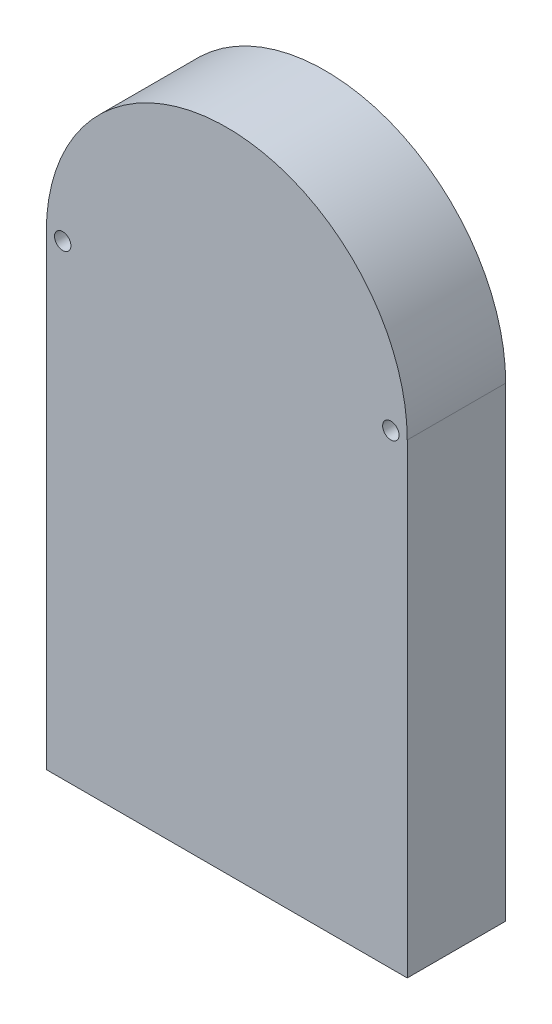
ISO-10303-21;
HEADER;
FILE_DESCRIPTION(('STEP AP214'),'2;1');
FILE_NAME('part.step','',(''),(''),'','','');
FILE_SCHEMA(('AUTOMOTIVE_DESIGN { 1 0 10303 214 1 1 1 1 }'));
ENDSEC;
DATA;
#1=APPLICATION_CONTEXT('core data for automotive mechanical design processes');
#2=APPLICATION_PROTOCOL_DEFINITION('international standard','automotive_design',2000,#1);
#3=PRODUCT_CONTEXT('',#1,'mechanical');
#4=PRODUCT('Part','Part','',(#3));
#5=PRODUCT_RELATED_PRODUCT_CATEGORY('part','',(#4));
#6=PRODUCT_DEFINITION_FORMATION('','',#4);
#7=PRODUCT_DEFINITION_CONTEXT('part definition',#1,'design');
#8=PRODUCT_DEFINITION('design','',#6,#7);
#9=PRODUCT_DEFINITION_SHAPE('','',#8);
#10=(LENGTH_UNIT() NAMED_UNIT(*) SI_UNIT(.MILLI.,.METRE.));
#11=(NAMED_UNIT(*) PLANE_ANGLE_UNIT() SI_UNIT($,.RADIAN.));
#12=(NAMED_UNIT(*) SI_UNIT($,.STERADIAN.) SOLID_ANGLE_UNIT());
#13=UNCERTAINTY_MEASURE_WITH_UNIT(LENGTH_MEASURE(1.E-05),#10,'distance_accuracy_value','');
#14=(GEOMETRIC_REPRESENTATION_CONTEXT(3) GLOBAL_UNCERTAINTY_ASSIGNED_CONTEXT((#13)) GLOBAL_UNIT_ASSIGNED_CONTEXT((#10,
#11,#12)) REPRESENTATION_CONTEXT('',''));
#15=CARTESIAN_POINT('',(0.,0.,0.));
#16=DIRECTION('',(0.,0.,1.));
#17=DIRECTION('',(1.,0.,0.));
#18=AXIS2_PLACEMENT_3D('',#15,#16,#17);
#19=CARTESIAN_POINT('',(42.7485380116959,10.,25.));
#20=DIRECTION('',(0.,-1.,0.));
#21=DIRECTION('',(0.,0.,-1.));
#22=AXIS2_PLACEMENT_3D('',#19,#20,#21);
#23=PLANE('',#22);
#24=CARTESIAN_POINT('',(-42.2514619883041,10.,15.));
#25=DIRECTION('',(0.,-1.,0.));
#26=DIRECTION('',(0.,0.,-1.));
#27=AXIS2_PLACEMENT_3D('',#24,#25,#26);
#28=CIRCLE('',#27,2.49999999999999);
#29=CARTESIAN_POINT('',(-42.2514619883041,10.,12.5));
#30=VERTEX_POINT('',#29);
#31=EDGE_CURVE('E256',#30,#30,#28,.F.);
#32=ORIENTED_EDGE('',*,*,#31,.F.);
#33=EDGE_LOOP('',(#32));
#34=FACE_BOUND('',#33,.T.);
#35=DIRECTION('',(-1.,0.,0.));
#36=VECTOR('',#35,1.);
#37=CARTESIAN_POINT('',(42.7485380116959,10.,0.));
#38=LINE('',#37,#36);
#39=CARTESIAN_POINT('',(42.7485380116959,10.,0.));
#40=VERTEX_POINT('',#39);
#41=CARTESIAN_POINT('',(-47.2514619883041,10.,0.));
#42=VERTEX_POINT('',#41);
#43=EDGE_CURVE('E139',#40,#42,#38,.T.);
#44=ORIENTED_EDGE('',*,*,#43,.T.);
#45=DIRECTION('',(0.,0.,-1.));
#46=VECTOR('',#45,1.);
#47=CARTESIAN_POINT('',(-47.2514619883041,10.,25.));
#48=LINE('',#47,#46);
#49=CARTESIAN_POINT('',(-47.2514619883041,10.,25.));
#50=VERTEX_POINT('',#49);
#51=EDGE_CURVE('E114',#50,#42,#48,.T.);
#52=ORIENTED_EDGE('',*,*,#51,.F.);
#53=DIRECTION('',(-1.,0.,0.));
#54=VECTOR('',#53,1.);
#55=CARTESIAN_POINT('',(42.7485380116959,10.,25.));
#56=LINE('',#55,#54);
#57=CARTESIAN_POINT('',(42.7485380116959,10.,25.));
#58=VERTEX_POINT('',#57);
#59=EDGE_CURVE('E118',#58,#50,#56,.T.);
#60=ORIENTED_EDGE('',*,*,#59,.F.);
#61=DIRECTION('',(0.,0.,-1.));
#62=VECTOR('',#61,1.);
#63=CARTESIAN_POINT('',(42.7485380116959,10.,25.));
#64=LINE('',#63,#62);
#65=EDGE_CURVE('E105',#58,#40,#64,.T.);
#66=ORIENTED_EDGE('',*,*,#65,.T.);
#67=EDGE_LOOP('',(#44,#52,#60,#66));
#68=FACE_BOUND('',#67,.T.);
#69=CARTESIAN_POINT('',(37.7485380116959,10.,15.));
#70=DIRECTION('',(0.,-1.,0.));
#71=DIRECTION('',(0.,0.,-1.));
#72=AXIS2_PLACEMENT_3D('',#69,#70,#71);
#73=CIRCLE('',#72,2.49999999999999);
#74=CARTESIAN_POINT('',(37.7485380116959,10.,12.5));
#75=VERTEX_POINT('',#74);
#76=EDGE_CURVE('E140',#75,#75,#73,.F.);
#77=ORIENTED_EDGE('',*,*,#76,.F.);
#78=EDGE_LOOP('',(#77));
#79=FACE_BOUND('',#78,.T.);
#80=ADVANCED_FACE('F33',(#34,#68,#79),#23,.F.);
#81=CARTESIAN_POINT('',(-57.2514619883041,0.,30.));
#82=DIRECTION('',(1.,0.,0.));
#83=DIRECTION('',(0.,0.,-1.));
#84=AXIS2_PLACEMENT_3D('',#81,#82,#83);
#85=PLANE('',#84);
#86=DIRECTION('',(0.,-1.,0.));
#87=VECTOR('',#86,1.);
#88=CARTESIAN_POINT('',(-57.2514619883041,0.,0.));
#89=LINE('',#88,#87);
#90=CARTESIAN_POINT('',(-57.2514619883041,142.,0.));
#91=VERTEX_POINT('',#90);
#92=CARTESIAN_POINT('',(-57.2514619883041,0.,0.));
#93=VERTEX_POINT('',#92);
#94=EDGE_CURVE('E146',#91,#93,#89,.T.);
#95=ORIENTED_EDGE('',*,*,#94,.T.);
#96=DIRECTION('',(0.,0.,-1.));
#97=VECTOR('',#96,1.);
#98=CARTESIAN_POINT('',(-57.2514619883041,0.,30.));
#99=LINE('',#98,#97);
#100=CARTESIAN_POINT('',(-57.2514619883041,0.,30.));
#101=VERTEX_POINT('',#100);
#102=EDGE_CURVE('E11',#101,#93,#99,.T.);
#103=ORIENTED_EDGE('',*,*,#102,.F.);
#104=DIRECTION('',(0.,-1.,0.));
#105=VECTOR('',#104,1.);
#106=CARTESIAN_POINT('',(-57.2514619883041,0.,30.));
#107=LINE('',#106,#105);
#108=CARTESIAN_POINT('',(-57.2514619883041,142.,30.));
#109=VERTEX_POINT('',#108);
#110=EDGE_CURVE('E150',#109,#101,#107,.T.);
#111=ORIENTED_EDGE('',*,*,#110,.F.);
#112=DIRECTION('',(0.,0.,-1.));
#113=VECTOR('',#112,1.);
#114=CARTESIAN_POINT('',(-57.2514619883041,142.,30.));
#115=LINE('',#114,#113);
#116=EDGE_CURVE('E156',#109,#91,#115,.T.);
#117=ORIENTED_EDGE('',*,*,#116,.T.);
#118=EDGE_LOOP('',(#95,#103,#111,#117));
#119=FACE_BOUND('',#118,.T.);
#120=ADVANCED_FACE('F35',(#119),#85,.F.);
#121=CARTESIAN_POINT('',(-57.2514619883041,0.,30.));
#122=DIRECTION('',(0.,1.,0.));
#123=DIRECTION('',(0.,0.,1.));
#124=AXIS2_PLACEMENT_3D('',#121,#122,#123);
#125=PLANE('',#124);
#126=CARTESIAN_POINT('',(-42.2514619883041,0.,15.));
#127=DIRECTION('',(0.,-1.,0.));
#128=DIRECTION('',(0.,0.,-1.));
#129=AXIS2_PLACEMENT_3D('',#126,#127,#128);
#130=CIRCLE('',#129,2.49999999999999);
#131=CARTESIAN_POINT('',(-42.2514619883041,0.,12.5));
#132=VERTEX_POINT('',#131);
#133=EDGE_CURVE('E255',#132,#132,#130,.T.);
#134=ORIENTED_EDGE('',*,*,#133,.F.);
#135=EDGE_LOOP('',(#134));
#136=FACE_BOUND('',#135,.T.);
#137=CARTESIAN_POINT('',(37.7485380116959,0.,15.));
#138=DIRECTION('',(0.,-1.,0.));
#139=DIRECTION('',(0.,0.,-1.));
#140=AXIS2_PLACEMENT_3D('',#137,#138,#139);
#141=CIRCLE('',#140,2.49999999999999);
#142=CARTESIAN_POINT('',(37.7485380116959,0.,12.5));
#143=VERTEX_POINT('',#142);
#144=EDGE_CURVE('E133',#143,#143,#141,.T.);
#145=ORIENTED_EDGE('',*,*,#144,.F.);
#146=EDGE_LOOP('',(#145));
#147=FACE_BOUND('',#146,.T.);
#148=DIRECTION('',(1.,0.,0.));
#149=VECTOR('',#148,1.);
#150=CARTESIAN_POINT('',(-57.2514619883041,0.,0.));
#151=LINE('',#150,#149);
#152=CARTESIAN_POINT('',(52.7485380116959,0.,0.));
#153=VERTEX_POINT('',#152);
#154=EDGE_CURVE('E159',#93,#153,#151,.T.);
#155=ORIENTED_EDGE('',*,*,#154,.T.);
#156=DIRECTION('',(0.,0.,-1.));
#157=VECTOR('',#156,1.);
#158=CARTESIAN_POINT('',(52.7485380116959,0.,30.));
#159=LINE('',#158,#157);
#160=CARTESIAN_POINT('',(52.7485380116959,0.,30.));
#161=VERTEX_POINT('',#160);
#162=EDGE_CURVE('E41',#161,#153,#159,.T.);
#163=ORIENTED_EDGE('',*,*,#162,.F.);
#164=DIRECTION('',(1.,0.,0.));
#165=VECTOR('',#164,1.);
#166=CARTESIAN_POINT('',(-57.2514619883041,0.,30.));
#167=LINE('',#166,#165);
#168=EDGE_CURVE('E85',#101,#161,#167,.T.);
#169=ORIENTED_EDGE('',*,*,#168,.F.);
#170=ORIENTED_EDGE('',*,*,#102,.T.);
#171=EDGE_LOOP('',(#155,#163,#169,#170));
#172=FACE_BOUND('',#171,.T.);
#173=ADVANCED_FACE('F188',(#136,#147,#172),#125,.F.);
#174=CARTESIAN_POINT('',(52.7485380116959,0.,30.));
#175=DIRECTION('',(-1.,0.,0.));
#176=DIRECTION('',(0.,0.,1.));
#177=AXIS2_PLACEMENT_3D('',#174,#175,#176);
#178=PLANE('',#177);
#179=DIRECTION('',(0.,1.,0.));
#180=VECTOR('',#179,1.);
#181=CARTESIAN_POINT('',(52.7485380116959,0.,0.));
#182=LINE('',#181,#180);
#183=CARTESIAN_POINT('',(52.7485380116959,142.,0.));
#184=VERTEX_POINT('',#183);
#185=EDGE_CURVE('E161',#153,#184,#182,.T.);
#186=ORIENTED_EDGE('',*,*,#185,.T.);
#187=DIRECTION('',(0.,0.,-1.));
#188=VECTOR('',#187,1.);
#189=CARTESIAN_POINT('',(52.7485380116959,142.,30.));
#190=LINE('',#189,#188);
#191=CARTESIAN_POINT('',(52.7485380116959,142.,30.));
#192=VERTEX_POINT('',#191);
#193=EDGE_CURVE('E165',#192,#184,#190,.T.);
#194=ORIENTED_EDGE('',*,*,#193,.F.);
#195=DIRECTION('',(0.,1.,0.));
#196=VECTOR('',#195,1.);
#197=CARTESIAN_POINT('',(52.7485380116959,0.,30.));
#198=LINE('',#197,#196);
#199=EDGE_CURVE('E153',#161,#192,#198,.T.);
#200=ORIENTED_EDGE('',*,*,#199,.F.);
#201=ORIENTED_EDGE('',*,*,#162,.T.);
#202=EDGE_LOOP('',(#186,#194,#200,#201));
#203=FACE_BOUND('',#202,.T.);
#204=ADVANCED_FACE('F170',(#203),#178,.F.);
#205=CARTESIAN_POINT('',(-2.25146198830407,142.,30.));
#206=DIRECTION('',(0.,0.,-1.));
#207=DIRECTION('',(-1.,0.,0.));
#208=AXIS2_PLACEMENT_3D('',#205,#206,#207);
#209=CYLINDRICAL_SURFACE('',#208,55.);
#210=CARTESIAN_POINT('',(-2.25146198830407,142.,0.));
#211=DIRECTION('',(0.,0.,1.));
#212=DIRECTION('',(-1.,0.,0.));
#213=AXIS2_PLACEMENT_3D('',#210,#211,#212);
#214=CIRCLE('',#213,55.);
#215=EDGE_CURVE('E78',#184,#91,#214,.T.);
#216=ORIENTED_EDGE('',*,*,#215,.T.);
#217=ORIENTED_EDGE('',*,*,#116,.F.);
#218=CARTESIAN_POINT('',(-2.25146198830407,142.,30.));
#219=DIRECTION('',(0.,0.,1.));
#220=DIRECTION('',(-1.,0.,0.));
#221=AXIS2_PLACEMENT_3D('',#218,#219,#220);
#222=CIRCLE('',#221,55.);
#223=EDGE_CURVE('E57',#192,#109,#222,.T.);
#224=ORIENTED_EDGE('',*,*,#223,.F.);
#225=ORIENTED_EDGE('',*,*,#193,.T.);
#226=EDGE_LOOP('',(#216,#217,#224,#225));
#227=FACE_BOUND('',#226,.T.);
#228=ADVANCED_FACE('F178',(#227),#209,.T.);
#229=CARTESIAN_POINT('',(-2.25146198830407,142.,30.));
#230=DIRECTION('',(0.,0.,-1.));
#231=DIRECTION('',(-1.,0.,0.));
#232=AXIS2_PLACEMENT_3D('',#229,#230,#231);
#233=PLANE('',#232);
#234=CARTESIAN_POINT('',(47.7485380116959,142.,30.));
#235=DIRECTION('',(0.,0.,-1.));
#236=DIRECTION('',(-1.,0.,0.));
#237=AXIS2_PLACEMENT_3D('',#234,#235,#236);
#238=CIRCLE('',#237,2.5);
#239=CARTESIAN_POINT('',(45.2485380116959,142.,30.));
#240=VERTEX_POINT('',#239);
#241=EDGE_CURVE('E247',#240,#240,#238,.T.);
#242=ORIENTED_EDGE('',*,*,#241,.T.);
#243=EDGE_LOOP('',(#242));
#244=FACE_BOUND('',#243,.T.);
#245=CARTESIAN_POINT('',(-52.2514619883041,142.,30.));
#246=DIRECTION('',(0.,0.,-1.));
#247=DIRECTION('',(-1.,0.,0.));
#248=AXIS2_PLACEMENT_3D('',#245,#246,#247);
#249=CIRCLE('',#248,2.5);
#250=CARTESIAN_POINT('',(-54.7514619883041,142.,30.));
#251=VERTEX_POINT('',#250);
#252=EDGE_CURVE('E252',#251,#251,#249,.T.);
#253=ORIENTED_EDGE('',*,*,#252,.T.);
#254=EDGE_LOOP('',(#253));
#255=FACE_BOUND('',#254,.T.);
#256=ORIENTED_EDGE('',*,*,#110,.T.);
#257=ORIENTED_EDGE('',*,*,#168,.T.);
#258=ORIENTED_EDGE('',*,*,#199,.T.);
#259=ORIENTED_EDGE('',*,*,#223,.T.);
#260=EDGE_LOOP('',(#256,#257,#258,#259));
#261=FACE_BOUND('',#260,.T.);
#262=ADVANCED_FACE('F180',(#244,#255,#261),#233,.F.);
#263=CARTESIAN_POINT('',(-2.25146198830407,142.,0.));
#264=DIRECTION('',(0.,0.,-1.));
#265=DIRECTION('',(-1.,0.,0.));
#266=AXIS2_PLACEMENT_3D('',#263,#264,#265);
#267=PLANE('',#266);
#268=CARTESIAN_POINT('',(47.7485380116959,142.,0.));
#269=DIRECTION('',(0.,0.,-1.));
#270=DIRECTION('',(-1.,0.,0.));
#271=AXIS2_PLACEMENT_3D('',#268,#269,#270);
#272=CIRCLE('',#271,2.49999999999999);
#273=CARTESIAN_POINT('',(45.248538011696,142.,0.));
#274=VERTEX_POINT('',#273);
#275=EDGE_CURVE('E211',#274,#274,#272,.T.);
#276=ORIENTED_EDGE('',*,*,#275,.F.);
#277=EDGE_LOOP('',(#276));
#278=FACE_BOUND('',#277,.T.);
#279=CARTESIAN_POINT('',(-52.2514619883041,142.,0.));
#280=DIRECTION('',(0.,0.,-1.));
#281=DIRECTION('',(-1.,0.,0.));
#282=AXIS2_PLACEMENT_3D('',#279,#280,#281);
#283=CIRCLE('',#282,2.49999999999999);
#284=CARTESIAN_POINT('',(-54.7514619883041,142.,0.));
#285=VERTEX_POINT('',#284);
#286=EDGE_CURVE('E215',#285,#285,#283,.T.);
#287=ORIENTED_EDGE('',*,*,#286,.F.);
#288=EDGE_LOOP('',(#287));
#289=FACE_BOUND('',#288,.T.);
#290=DIRECTION('',(0.,-1.,0.));
#291=VECTOR('',#290,1.);
#292=CARTESIAN_POINT('',(42.7485380116959,10.,0.));
#293=LINE('',#292,#291);
#294=CARTESIAN_POINT('',(42.7485380116959,142.,0.));
#295=VERTEX_POINT('',#294);
#296=EDGE_CURVE('E48',#295,#40,#293,.T.);
#297=ORIENTED_EDGE('',*,*,#296,.F.);
#298=CARTESIAN_POINT('',(-2.25146198830407,142.,0.));
#299=DIRECTION('',(0.,0.,-1.));
#300=DIRECTION('',(1.,0.,0.));
#301=AXIS2_PLACEMENT_3D('',#298,#299,#300);
#302=CIRCLE('',#301,45.);
#303=CARTESIAN_POINT('',(-47.2514619883041,142.,0.));
#304=VERTEX_POINT('',#303);
#305=EDGE_CURVE('E127',#304,#295,#302,.T.);
#306=ORIENTED_EDGE('',*,*,#305,.F.);
#307=DIRECTION('',(0.,1.,0.));
#308=VECTOR('',#307,1.);
#309=CARTESIAN_POINT('',(-47.2514619883041,10.,0.));
#310=LINE('',#309,#308);
#311=EDGE_CURVE('E130',#42,#304,#310,.T.);
#312=ORIENTED_EDGE('',*,*,#311,.F.);
#313=ORIENTED_EDGE('',*,*,#43,.F.);
#314=EDGE_LOOP('',(#297,#306,#312,#313));
#315=FACE_BOUND('',#314,.T.);
#316=ORIENTED_EDGE('',*,*,#94,.F.);
#317=ORIENTED_EDGE('',*,*,#215,.F.);
#318=ORIENTED_EDGE('',*,*,#185,.F.);
#319=ORIENTED_EDGE('',*,*,#154,.F.);
#320=EDGE_LOOP('',(#316,#317,#318,#319));
#321=FACE_BOUND('',#320,.T.);
#322=ADVANCED_FACE('F174',(#278,#289,#315,#321),#267,.T.);
#323=CARTESIAN_POINT('',(42.7485380116959,10.,25.));
#324=DIRECTION('',(1.,0.,0.));
#325=DIRECTION('',(0.,0.,-1.));
#326=AXIS2_PLACEMENT_3D('',#323,#324,#325);
#327=PLANE('',#326);
#328=ORIENTED_EDGE('',*,*,#296,.T.);
#329=ORIENTED_EDGE('',*,*,#65,.F.);
#330=DIRECTION('',(0.,-1.,0.));
#331=VECTOR('',#330,1.);
#332=CARTESIAN_POINT('',(42.7485380116959,10.,25.));
#333=LINE('',#332,#331);
#334=CARTESIAN_POINT('',(42.7485380116959,142.,25.));
#335=VERTEX_POINT('',#334);
#336=EDGE_CURVE('E109',#335,#58,#333,.T.);
#337=ORIENTED_EDGE('',*,*,#336,.F.);
#338=DIRECTION('',(0.,0.,-1.));
#339=VECTOR('',#338,1.);
#340=CARTESIAN_POINT('',(42.7485380116959,142.,25.));
#341=LINE('',#340,#339);
#342=EDGE_CURVE('E144',#335,#295,#341,.T.);
#343=ORIENTED_EDGE('',*,*,#342,.T.);
#344=EDGE_LOOP('',(#328,#329,#337,#343));
#345=FACE_BOUND('',#344,.T.);
#346=ADVANCED_FACE('F107',(#345),#327,.F.);
#347=CARTESIAN_POINT('',(-2.25146198830407,142.,25.));
#348=DIRECTION('',(0.,0.,-1.));
#349=DIRECTION('',(-1.,0.,0.));
#350=AXIS2_PLACEMENT_3D('',#347,#348,#349);
#351=CYLINDRICAL_SURFACE('',#350,45.);
#352=ORIENTED_EDGE('',*,*,#305,.T.);
#353=ORIENTED_EDGE('',*,*,#342,.F.);
#354=CARTESIAN_POINT('',(-2.25146198830407,142.,25.));
#355=DIRECTION('',(0.,0.,-1.));
#356=DIRECTION('',(1.,0.,0.));
#357=AXIS2_PLACEMENT_3D('',#354,#355,#356);
#358=CIRCLE('',#357,45.);
#359=CARTESIAN_POINT('',(-47.2514619883041,142.,25.));
#360=VERTEX_POINT('',#359);
#361=EDGE_CURVE('E115',#360,#335,#358,.T.);
#362=ORIENTED_EDGE('',*,*,#361,.F.);
#363=DIRECTION('',(0.,0.,-1.));
#364=VECTOR('',#363,1.);
#365=CARTESIAN_POINT('',(-47.2514619883041,142.,25.));
#366=LINE('',#365,#364);
#367=EDGE_CURVE('E147',#360,#304,#366,.T.);
#368=ORIENTED_EDGE('',*,*,#367,.T.);
#369=EDGE_LOOP('',(#352,#353,#362,#368));
#370=FACE_BOUND('',#369,.T.);
#371=ADVANCED_FACE('F203',(#370),#351,.F.);
#372=CARTESIAN_POINT('',(-47.2514619883041,10.,25.));
#373=DIRECTION('',(-1.,0.,0.));
#374=DIRECTION('',(0.,-1.,0.));
#375=AXIS2_PLACEMENT_3D('',#372,#373,#374);
#376=PLANE('',#375);
#377=ORIENTED_EDGE('',*,*,#311,.T.);
#378=ORIENTED_EDGE('',*,*,#367,.F.);
#379=DIRECTION('',(0.,1.,0.));
#380=VECTOR('',#379,1.);
#381=CARTESIAN_POINT('',(-47.2514619883041,10.,25.));
#382=LINE('',#381,#380);
#383=EDGE_CURVE('E123',#50,#360,#382,.T.);
#384=ORIENTED_EDGE('',*,*,#383,.F.);
#385=ORIENTED_EDGE('',*,*,#51,.T.);
#386=EDGE_LOOP('',(#377,#378,#384,#385));
#387=FACE_BOUND('',#386,.T.);
#388=ADVANCED_FACE('F200',(#387),#376,.F.);
#389=CARTESIAN_POINT('',(-2.25146198830407,142.,25.));
#390=DIRECTION('',(0.,0.,1.));
#391=DIRECTION('',(1.,0.,0.));
#392=AXIS2_PLACEMENT_3D('',#389,#390,#391);
#393=PLANE('',#392);
#394=ORIENTED_EDGE('',*,*,#336,.T.);
#395=ORIENTED_EDGE('',*,*,#59,.T.);
#396=ORIENTED_EDGE('',*,*,#383,.T.);
#397=ORIENTED_EDGE('',*,*,#361,.T.);
#398=EDGE_LOOP('',(#394,#395,#396,#397));
#399=FACE_BOUND('',#398,.T.);
#400=ADVANCED_FACE('F125',(#399),#393,.F.);
#401=CARTESIAN_POINT('',(37.7485380116959,0.,15.));
#402=DIRECTION('',(0.,-1.,0.));
#403=DIRECTION('',(0.,0.,-1.));
#404=AXIS2_PLACEMENT_3D('',#401,#402,#403);
#405=CYLINDRICAL_SURFACE('',#404,2.49999999999999);
#406=ORIENTED_EDGE('',*,*,#76,.T.);
#407=EDGE_LOOP('',(#406));
#408=FACE_BOUND('',#407,.T.);
#409=ORIENTED_EDGE('',*,*,#144,.T.);
#410=EDGE_LOOP('',(#409));
#411=FACE_BOUND('',#410,.T.);
#412=ADVANCED_FACE('F227',(#408,#411),#405,.F.);
#413=CARTESIAN_POINT('',(-42.2514619883041,0.,15.));
#414=DIRECTION('',(0.,-1.,0.));
#415=DIRECTION('',(0.,0.,-1.));
#416=AXIS2_PLACEMENT_3D('',#413,#414,#415);
#417=CYLINDRICAL_SURFACE('',#416,2.49999999999999);
#418=ORIENTED_EDGE('',*,*,#31,.T.);
#419=EDGE_LOOP('',(#418));
#420=FACE_BOUND('',#419,.T.);
#421=ORIENTED_EDGE('',*,*,#133,.T.);
#422=EDGE_LOOP('',(#421));
#423=FACE_BOUND('',#422,.T.);
#424=ADVANCED_FACE('F230',(#420,#423),#417,.F.);
#425=CARTESIAN_POINT('',(-52.2514619883041,142.,0.));
#426=DIRECTION('',(0.,0.,-1.));
#427=DIRECTION('',(-1.,0.,0.));
#428=AXIS2_PLACEMENT_3D('',#425,#426,#427);
#429=CYLINDRICAL_SURFACE('',#428,2.49999999999999);
#430=ORIENTED_EDGE('',*,*,#252,.F.);
#431=EDGE_LOOP('',(#430));
#432=FACE_BOUND('',#431,.T.);
#433=ORIENTED_EDGE('',*,*,#286,.T.);
#434=EDGE_LOOP('',(#433));
#435=FACE_BOUND('',#434,.T.);
#436=ADVANCED_FACE('F234',(#432,#435),#429,.F.);
#437=CARTESIAN_POINT('',(47.7485380116959,142.,0.));
#438=DIRECTION('',(0.,0.,-1.));
#439=DIRECTION('',(-1.,0.,0.));
#440=AXIS2_PLACEMENT_3D('',#437,#438,#439);
#441=CYLINDRICAL_SURFACE('',#440,2.49999999999999);
#442=ORIENTED_EDGE('',*,*,#241,.F.);
#443=EDGE_LOOP('',(#442));
#444=FACE_BOUND('',#443,.T.);
#445=ORIENTED_EDGE('',*,*,#275,.T.);
#446=EDGE_LOOP('',(#445));
#447=FACE_BOUND('',#446,.T.);
#448=ADVANCED_FACE('F238',(#444,#447),#441,.F.);
#449=CLOSED_SHELL('',(#80,#120,#173,#204,#228,#262,#322,#346,#371,#388,#400,#412,#424,#436,#448));
#450=MANIFOLD_SOLID_BREP('B2',#449);
#451=ADVANCED_BREP_SHAPE_REPRESENTATION('',(#18,#450),#14);
#452=SHAPE_DEFINITION_REPRESENTATION(#9,#451);
ENDSEC;
END-ISO-10303-21;
